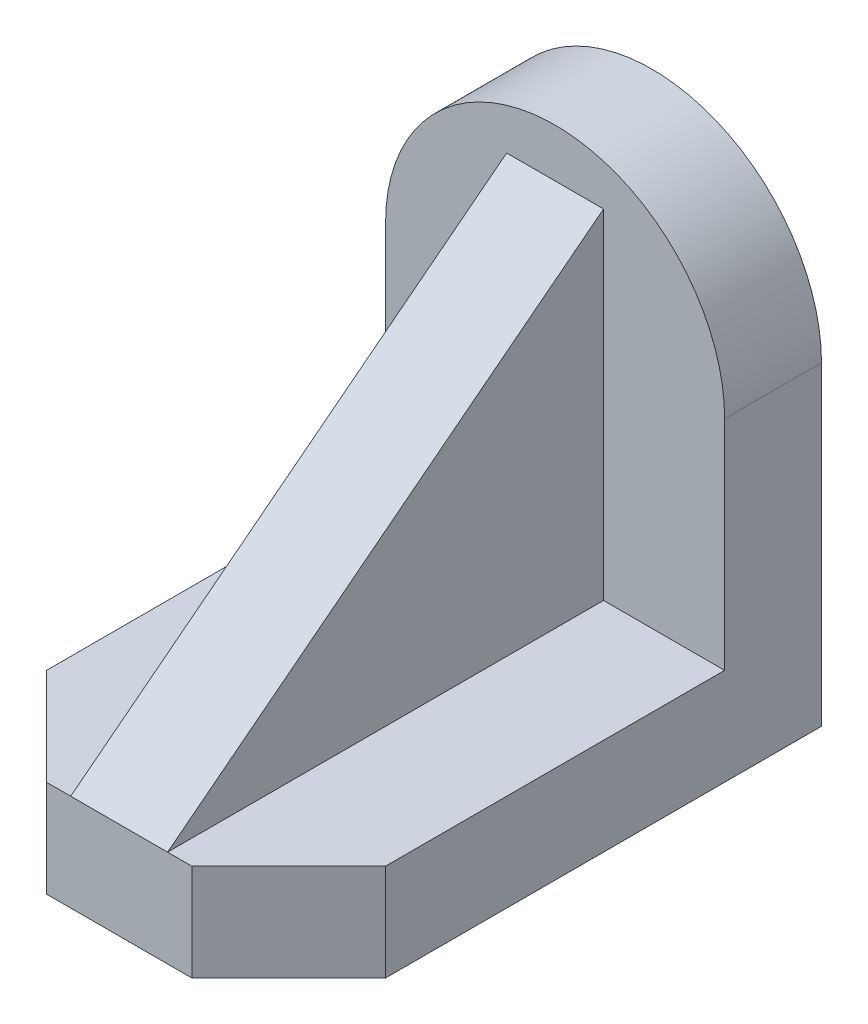
ISO-10303-21;
HEADER;
FILE_DESCRIPTION(('STEP AP214'),'2;1');
FILE_NAME('part.step','',(''),(''),'','','');
FILE_SCHEMA(('AUTOMOTIVE_DESIGN { 1 0 10303 214 1 1 1 1 }'));
ENDSEC;
DATA;
#1=APPLICATION_CONTEXT('core data for automotive mechanical design processes');
#2=APPLICATION_PROTOCOL_DEFINITION('international standard','automotive_design',2000,#1);
#3=PRODUCT_CONTEXT('',#1,'mechanical');
#4=PRODUCT('Part','Part','',(#3));
#5=PRODUCT_RELATED_PRODUCT_CATEGORY('part','',(#4));
#6=PRODUCT_DEFINITION_FORMATION('','',#4);
#7=PRODUCT_DEFINITION_CONTEXT('part definition',#1,'design');
#8=PRODUCT_DEFINITION('design','',#6,#7);
#9=PRODUCT_DEFINITION_SHAPE('','',#8);
#10=(LENGTH_UNIT() NAMED_UNIT(*) SI_UNIT(.MILLI.,.METRE.));
#11=(NAMED_UNIT(*) PLANE_ANGLE_UNIT() SI_UNIT($,.RADIAN.));
#12=(NAMED_UNIT(*) SI_UNIT($,.STERADIAN.) SOLID_ANGLE_UNIT());
#13=UNCERTAINTY_MEASURE_WITH_UNIT(LENGTH_MEASURE(1.E-05),#10,'distance_accuracy_value','');
#14=(GEOMETRIC_REPRESENTATION_CONTEXT(3) GLOBAL_UNCERTAINTY_ASSIGNED_CONTEXT((#13)) GLOBAL_UNIT_ASSIGNED_CONTEXT((#10,
#11,#12)) REPRESENTATION_CONTEXT('',''));
#15=CARTESIAN_POINT('',(0.,0.,0.));
#16=DIRECTION('',(0.,0.,1.));
#17=DIRECTION('',(1.,0.,0.));
#18=AXIS2_PLACEMENT_3D('',#15,#16,#17);
#19=CARTESIAN_POINT('',(0.,12.,0.));
#20=DIRECTION('',(0.,-1.,0.));
#21=DIRECTION('',(0.,0.,-1.));
#22=AXIS2_PLACEMENT_3D('',#19,#20,#21);
#23=PLANE('',#22);
#24=DIRECTION('',(0.,0.,-1.));
#25=VECTOR('',#24,1.);
#26=CARTESIAN_POINT('',(-6.,12.,33.));
#27=LINE('',#26,#25);
#28=CARTESIAN_POINT('',(-6.,12.,33.));
#29=VERTEX_POINT('',#28);
#30=CARTESIAN_POINT('',(-6.,12.,-21.));
#31=VERTEX_POINT('',#30);
#32=EDGE_CURVE('E142',#29,#31,#27,.T.);
#33=ORIENTED_EDGE('',*,*,#32,.T.);
#34=DIRECTION('',(1.,0.,0.));
#35=VECTOR('',#34,1.);
#36=CARTESIAN_POINT('',(21.,12.,-21.));
#37=LINE('',#36,#35);
#38=CARTESIAN_POINT('',(-21.,12.,-21.));
#39=VERTEX_POINT('',#38);
#40=EDGE_CURVE('E127',#39,#31,#37,.T.);
#41=ORIENTED_EDGE('',*,*,#40,.F.);
#42=DIRECTION('',(0.,0.,1.));
#43=VECTOR('',#42,1.);
#44=CARTESIAN_POINT('',(-21.,12.,33.));
#45=LINE('',#44,#43);
#46=CARTESIAN_POINT('',(-21.,12.,21.));
#47=VERTEX_POINT('',#46);
#48=EDGE_CURVE('E189',#39,#47,#45,.T.);
#49=ORIENTED_EDGE('',*,*,#48,.T.);
#50=DIRECTION('',(-0.707106781186546,0.,-0.707106781186549));
#51=VECTOR('',#50,1.);
#52=CARTESIAN_POINT('',(-9.00000000000002,12.,33.));
#53=LINE('',#52,#51);
#54=CARTESIAN_POINT('',(-9.00000000000002,12.,33.));
#55=VERTEX_POINT('',#54);
#56=EDGE_CURVE('E51',#47,#55,#53,.F.);
#57=ORIENTED_EDGE('',*,*,#56,.T.);
#58=DIRECTION('',(1.,0.,0.));
#59=VECTOR('',#58,1.);
#60=CARTESIAN_POINT('',(-21.,12.,33.));
#61=LINE('',#60,#59);
#62=EDGE_CURVE('E143',#55,#29,#61,.T.);
#63=ORIENTED_EDGE('',*,*,#62,.T.);
#64=EDGE_LOOP('',(#33,#41,#49,#57,#63));
#65=FACE_BOUND('',#64,.T.);
#66=ADVANCED_FACE('F41',(#65),#23,.F.);
#67=CARTESIAN_POINT('',(6.,12.,-21.));
#68=VERTEX_POINT('',#67);
#69=CARTESIAN_POINT('',(21.,12.,-21.));
#70=VERTEX_POINT('',#69);
#71=EDGE_CURVE('E139',#68,#70,#37,.T.);
#72=ORIENTED_EDGE('',*,*,#71,.F.);
#73=DIRECTION('',(0.,0.,-1.));
#74=VECTOR('',#73,1.);
#75=CARTESIAN_POINT('',(6.,12.,33.));
#76=LINE('',#75,#74);
#77=CARTESIAN_POINT('',(6.,12.,33.));
#78=VERTEX_POINT('',#77);
#79=EDGE_CURVE('E58',#78,#68,#76,.T.);
#80=ORIENTED_EDGE('',*,*,#79,.F.);
#81=CARTESIAN_POINT('',(8.99999999999993,12.,33.));
#82=VERTEX_POINT('',#81);
#83=EDGE_CURVE('E193',#78,#82,#61,.T.);
#84=ORIENTED_EDGE('',*,*,#83,.T.);
#85=DIRECTION('',(-0.707106781186549,0.,0.707106781186546));
#86=VECTOR('',#85,1.);
#87=CARTESIAN_POINT('',(21.,12.,21.));
#88=LINE('',#87,#86);
#89=CARTESIAN_POINT('',(21.,12.,21.));
#90=VERTEX_POINT('',#89);
#91=EDGE_CURVE('E234',#82,#90,#88,.F.);
#92=ORIENTED_EDGE('',*,*,#91,.T.);
#93=DIRECTION('',(0.,0.,-1.));
#94=VECTOR('',#93,1.);
#95=CARTESIAN_POINT('',(21.,12.,33.));
#96=LINE('',#95,#94);
#97=EDGE_CURVE('E185',#90,#70,#96,.T.);
#98=ORIENTED_EDGE('',*,*,#97,.T.);
#99=EDGE_LOOP('',(#72,#80,#84,#92,#98));
#100=FACE_BOUND('',#99,.T.);
#101=ADVANCED_FACE('F265',(#100),#23,.F.);
#102=CARTESIAN_POINT('',(21.,12.,33.));
#103=DIRECTION('',(-1.,0.,0.));
#104=DIRECTION('',(0.,0.,1.));
#105=AXIS2_PLACEMENT_3D('',#102,#103,#104);
#106=PLANE('',#105);
#107=ORIENTED_EDGE('',*,*,#97,.F.);
#108=DIRECTION('',(0.,-1.,0.));
#109=VECTOR('',#108,1.);
#110=CARTESIAN_POINT('',(21.,12.,21.));
#111=LINE('',#110,#109);
#112=CARTESIAN_POINT('',(21.,0.,21.));
#113=VERTEX_POINT('',#112);
#114=EDGE_CURVE('E11',#90,#113,#111,.T.);
#115=ORIENTED_EDGE('',*,*,#114,.T.);
#116=DIRECTION('',(0.,0.,-1.));
#117=VECTOR('',#116,1.);
#118=CARTESIAN_POINT('',(21.,0.,33.));
#119=LINE('',#118,#117);
#120=CARTESIAN_POINT('',(21.,0.,-33.));
#121=VERTEX_POINT('',#120);
#122=EDGE_CURVE('E184',#113,#121,#119,.T.);
#123=ORIENTED_EDGE('',*,*,#122,.T.);
#124=DIRECTION('',(0.,-1.,0.));
#125=VECTOR('',#124,1.);
#126=CARTESIAN_POINT('',(21.,12.,-33.));
#127=LINE('',#126,#125);
#128=CARTESIAN_POINT('',(21.,39.,-33.));
#129=VERTEX_POINT('',#128);
#130=EDGE_CURVE('E212',#129,#121,#127,.T.);
#131=ORIENTED_EDGE('',*,*,#130,.F.);
#132=DIRECTION('',(0.,0.,-1.));
#133=VECTOR('',#132,1.);
#134=CARTESIAN_POINT('',(21.,39.,-33.));
#135=LINE('',#134,#133);
#136=CARTESIAN_POINT('',(21.,39.,-21.));
#137=VERTEX_POINT('',#136);
#138=EDGE_CURVE('E138',#137,#129,#135,.T.);
#139=ORIENTED_EDGE('',*,*,#138,.F.);
#140=DIRECTION('',(0.,-1.,0.));
#141=VECTOR('',#140,1.);
#142=CARTESIAN_POINT('',(21.,39.,-21.));
#143=LINE('',#142,#141);
#144=EDGE_CURVE('E177',#137,#70,#143,.T.);
#145=ORIENTED_EDGE('',*,*,#144,.T.);
#146=EDGE_LOOP('',(#107,#115,#123,#131,#139,#145));
#147=FACE_BOUND('',#146,.T.);
#148=ADVANCED_FACE('F259',(#147),#106,.F.);
#149=CARTESIAN_POINT('',(-21.,12.,-33.));
#150=DIRECTION('',(0.,0.,1.));
#151=DIRECTION('',(1.,0.,0.));
#152=AXIS2_PLACEMENT_3D('',#149,#150,#151);
#153=PLANE('',#152);
#154=DIRECTION('',(-1.,0.,0.));
#155=VECTOR('',#154,1.);
#156=CARTESIAN_POINT('',(-21.,0.,-33.));
#157=LINE('',#156,#155);
#158=CARTESIAN_POINT('',(-21.,0.,-33.));
#159=VERTEX_POINT('',#158);
#160=EDGE_CURVE('E199',#121,#159,#157,.T.);
#161=ORIENTED_EDGE('',*,*,#160,.T.);
#162=DIRECTION('',(0.,-1.,0.));
#163=VECTOR('',#162,1.);
#164=CARTESIAN_POINT('',(-21.,12.,-33.));
#165=LINE('',#164,#163);
#166=CARTESIAN_POINT('',(-21.,38.9999999999999,-33.));
#167=VERTEX_POINT('',#166);
#168=EDGE_CURVE('E196',#167,#159,#165,.T.);
#169=ORIENTED_EDGE('',*,*,#168,.F.);
#170=CARTESIAN_POINT('',(0.,39.,-33.));
#171=DIRECTION('',(0.,0.,-1.));
#172=DIRECTION('',(-1.,0.,0.));
#173=AXIS2_PLACEMENT_3D('',#170,#171,#172);
#174=CIRCLE('',#173,21.);
#175=EDGE_CURVE('E163',#167,#129,#174,.T.);
#176=ORIENTED_EDGE('',*,*,#175,.T.);
#177=ORIENTED_EDGE('',*,*,#130,.T.);
#178=EDGE_LOOP('',(#161,#169,#176,#177));
#179=FACE_BOUND('',#178,.T.);
#180=ADVANCED_FACE('F253',(#179),#153,.F.);
#181=CARTESIAN_POINT('',(-21.,12.,33.));
#182=DIRECTION('',(1.,0.,0.));
#183=DIRECTION('',(0.,0.,-1.));
#184=AXIS2_PLACEMENT_3D('',#181,#182,#183);
#185=PLANE('',#184);
#186=DIRECTION('',(0.,0.,1.));
#187=VECTOR('',#186,1.);
#188=CARTESIAN_POINT('',(-21.,0.,33.));
#189=LINE('',#188,#187);
#190=CARTESIAN_POINT('',(-21.,0.,21.));
#191=VERTEX_POINT('',#190);
#192=EDGE_CURVE('E202',#159,#191,#189,.T.);
#193=ORIENTED_EDGE('',*,*,#192,.T.);
#194=DIRECTION('',(0.,1.,0.));
#195=VECTOR('',#194,1.);
#196=CARTESIAN_POINT('',(-21.,12.,21.));
#197=LINE('',#196,#195);
#198=EDGE_CURVE('E230',#191,#47,#197,.T.);
#199=ORIENTED_EDGE('',*,*,#198,.T.);
#200=ORIENTED_EDGE('',*,*,#48,.F.);
#201=DIRECTION('',(0.,-1.,0.));
#202=VECTOR('',#201,1.);
#203=CARTESIAN_POINT('',(-21.,39.,-21.));
#204=LINE('',#203,#202);
#205=CARTESIAN_POINT('',(-21.,39.,-21.));
#206=VERTEX_POINT('',#205);
#207=EDGE_CURVE('E134',#206,#39,#204,.T.);
#208=ORIENTED_EDGE('',*,*,#207,.F.);
#209=DIRECTION('',(0.,0.,1.));
#210=VECTOR('',#209,1.);
#211=CARTESIAN_POINT('',(-21.,39.,-33.));
#212=LINE('',#211,#210);
#213=EDGE_CURVE('E174',#167,#206,#212,.T.);
#214=ORIENTED_EDGE('',*,*,#213,.F.);
#215=ORIENTED_EDGE('',*,*,#168,.T.);
#216=EDGE_LOOP('',(#193,#199,#200,#208,#214,#215));
#217=FACE_BOUND('',#216,.T.);
#218=ADVANCED_FACE('F249',(#217),#185,.F.);
#219=CARTESIAN_POINT('',(-21.,12.,33.));
#220=DIRECTION('',(0.,0.,-1.));
#221=DIRECTION('',(-1.,0.,0.));
#222=AXIS2_PLACEMENT_3D('',#219,#220,#221);
#223=PLANE('',#222);
#224=ORIENTED_EDGE('',*,*,#62,.F.);
#225=DIRECTION('',(0.,-1.,0.));
#226=VECTOR('',#225,1.);
#227=CARTESIAN_POINT('',(-9.00000000000002,12.,33.));
#228=LINE('',#227,#226);
#229=CARTESIAN_POINT('',(-9.00000000000002,0.,33.));
#230=VERTEX_POINT('',#229);
#231=EDGE_CURVE('E220',#55,#230,#228,.T.);
#232=ORIENTED_EDGE('',*,*,#231,.T.);
#233=DIRECTION('',(1.,0.,0.));
#234=VECTOR('',#233,1.);
#235=CARTESIAN_POINT('',(-21.,0.,33.));
#236=LINE('',#235,#234);
#237=CARTESIAN_POINT('',(8.99999999999993,0.,33.));
#238=VERTEX_POINT('',#237);
#239=EDGE_CURVE('E190',#230,#238,#236,.T.);
#240=ORIENTED_EDGE('',*,*,#239,.T.);
#241=DIRECTION('',(0.,1.,0.));
#242=VECTOR('',#241,1.);
#243=CARTESIAN_POINT('',(8.99999999999993,12.,33.));
#244=LINE('',#243,#242);
#245=EDGE_CURVE('E216',#238,#82,#244,.T.);
#246=ORIENTED_EDGE('',*,*,#245,.T.);
#247=ORIENTED_EDGE('',*,*,#83,.F.);
#248=DIRECTION('',(-1.,0.,0.));
#249=VECTOR('',#248,1.);
#250=CARTESIAN_POINT('',(6.,12.,33.));
#251=LINE('',#250,#249);
#252=EDGE_CURVE('E65',#78,#29,#251,.T.);
#253=ORIENTED_EDGE('',*,*,#252,.T.);
#254=EDGE_LOOP('',(#224,#232,#240,#246,#247,#253));
#255=FACE_BOUND('',#254,.T.);
#256=ADVANCED_FACE('F241',(#255),#223,.F.);
#257=CARTESIAN_POINT('',(0.,0.,0.));
#258=DIRECTION('',(0.,-1.,0.));
#259=DIRECTION('',(0.,0.,-1.));
#260=AXIS2_PLACEMENT_3D('',#257,#258,#259);
#261=PLANE('',#260);
#262=ORIENTED_EDGE('',*,*,#239,.F.);
#263=DIRECTION('',(0.707106781186546,0.,0.707106781186549));
#264=VECTOR('',#263,1.);
#265=CARTESIAN_POINT('',(-21.,0.,21.));
#266=LINE('',#265,#264);
#267=EDGE_CURVE('E227',#230,#191,#266,.F.);
#268=ORIENTED_EDGE('',*,*,#267,.T.);
#269=ORIENTED_EDGE('',*,*,#192,.F.);
#270=ORIENTED_EDGE('',*,*,#160,.F.);
#271=ORIENTED_EDGE('',*,*,#122,.F.);
#272=DIRECTION('',(0.707106781186549,0.,-0.707106781186546));
#273=VECTOR('',#272,1.);
#274=CARTESIAN_POINT('',(21.,0.,21.));
#275=LINE('',#274,#273);
#276=EDGE_CURVE('E224',#113,#238,#275,.F.);
#277=ORIENTED_EDGE('',*,*,#276,.T.);
#278=EDGE_LOOP('',(#262,#268,#269,#270,#271,#277));
#279=FACE_BOUND('',#278,.T.);
#280=ADVANCED_FACE('F246',(#279),#261,.T.);
#281=CARTESIAN_POINT('',(-9.00000000000002,12.,33.));
#282=DIRECTION('',(0.707106781186549,0.,-0.707106781186546));
#283=DIRECTION('',(0.,-1.,0.));
#284=AXIS2_PLACEMENT_3D('',#281,#282,#283);
#285=PLANE('',#284);
#286=ORIENTED_EDGE('',*,*,#56,.F.);
#287=ORIENTED_EDGE('',*,*,#198,.F.);
#288=ORIENTED_EDGE('',*,*,#267,.F.);
#289=ORIENTED_EDGE('',*,*,#231,.F.);
#290=EDGE_LOOP('',(#286,#287,#288,#289));
#291=FACE_BOUND('',#290,.T.);
#292=ADVANCED_FACE('F243',(#291),#285,.F.);
#293=CARTESIAN_POINT('',(21.,12.,21.));
#294=DIRECTION('',(-0.707106781186546,0.,-0.707106781186549));
#295=DIRECTION('',(0.,-1.,0.));
#296=AXIS2_PLACEMENT_3D('',#293,#294,#295);
#297=PLANE('',#296);
#298=ORIENTED_EDGE('',*,*,#91,.F.);
#299=ORIENTED_EDGE('',*,*,#245,.F.);
#300=ORIENTED_EDGE('',*,*,#276,.F.);
#301=ORIENTED_EDGE('',*,*,#114,.F.);
#302=EDGE_LOOP('',(#298,#299,#300,#301));
#303=FACE_BOUND('',#302,.T.);
#304=ADVANCED_FACE('F44',(#303),#297,.F.);
#305=CARTESIAN_POINT('',(21.,39.,-21.));
#306=DIRECTION('',(0.,0.,-1.));
#307=DIRECTION('',(-1.,0.,0.));
#308=AXIS2_PLACEMENT_3D('',#305,#306,#307);
#309=PLANE('',#308);
#310=DIRECTION('',(-1.,0.,0.));
#311=VECTOR('',#310,1.);
#312=CARTESIAN_POINT('',(6.,54.,-21.));
#313=LINE('',#312,#311);
#314=CARTESIAN_POINT('',(6.,54.,-21.));
#315=VERTEX_POINT('',#314);
#316=CARTESIAN_POINT('',(-6.,54.,-21.));
#317=VERTEX_POINT('',#316);
#318=EDGE_CURVE('E159',#315,#317,#313,.T.);
#319=ORIENTED_EDGE('',*,*,#318,.F.);
#320=DIRECTION('',(0.,1.,0.));
#321=VECTOR('',#320,1.);
#322=CARTESIAN_POINT('',(6.,12.,-21.));
#323=LINE('',#322,#321);
#324=EDGE_CURVE('E271',#68,#315,#323,.T.);
#325=ORIENTED_EDGE('',*,*,#324,.F.);
#326=ORIENTED_EDGE('',*,*,#71,.T.);
#327=ORIENTED_EDGE('',*,*,#144,.F.);
#328=CARTESIAN_POINT('',(0.,39.,-21.));
#329=DIRECTION('',(0.,0.,-1.));
#330=DIRECTION('',(-1.,0.,0.));
#331=AXIS2_PLACEMENT_3D('',#328,#329,#330);
#332=CIRCLE('',#331,21.);
#333=EDGE_CURVE('E167',#206,#137,#332,.T.);
#334=ORIENTED_EDGE('',*,*,#333,.F.);
#335=ORIENTED_EDGE('',*,*,#207,.T.);
#336=ORIENTED_EDGE('',*,*,#40,.T.);
#337=DIRECTION('',(0.,1.,0.));
#338=VECTOR('',#337,1.);
#339=CARTESIAN_POINT('',(-6.,12.,-21.));
#340=LINE('',#339,#338);
#341=EDGE_CURVE('E131',#31,#317,#340,.T.);
#342=ORIENTED_EDGE('',*,*,#341,.T.);
#343=EDGE_LOOP('',(#319,#325,#326,#327,#334,#335,#336,#342));
#344=FACE_BOUND('',#343,.T.);
#345=ADVANCED_FACE('F129',(#344),#309,.F.);
#346=CARTESIAN_POINT('',(0.,39.,-33.));
#347=DIRECTION('',(0.,0.,-1.));
#348=DIRECTION('',(-1.,0.,0.));
#349=AXIS2_PLACEMENT_3D('',#346,#347,#348);
#350=CYLINDRICAL_SURFACE('',#349,21.);
#351=ORIENTED_EDGE('',*,*,#333,.T.);
#352=ORIENTED_EDGE('',*,*,#138,.T.);
#353=ORIENTED_EDGE('',*,*,#175,.F.);
#354=ORIENTED_EDGE('',*,*,#213,.T.);
#355=EDGE_LOOP('',(#351,#352,#353,#354));
#356=FACE_BOUND('',#355,.T.);
#357=ADVANCED_FACE('F255',(#356),#350,.T.);
#358=CARTESIAN_POINT('',(6.,54.,-21.));
#359=DIRECTION('',(0.,-0.789352217376326,-0.613940613514921));
#360=DIRECTION('',(0.,0.613940613514921,-0.789352217376326));
#361=AXIS2_PLACEMENT_3D('',#358,#359,#360);
#362=PLANE('',#361);
#363=DIRECTION('',(0.,-0.613940613514921,0.789352217376326));
#364=VECTOR('',#363,1.);
#365=CARTESIAN_POINT('',(-6.,54.,-21.));
#366=LINE('',#365,#364);
#367=EDGE_CURVE('E150',#317,#29,#366,.T.);
#368=ORIENTED_EDGE('',*,*,#367,.T.);
#369=ORIENTED_EDGE('',*,*,#252,.F.);
#370=DIRECTION('',(0.,-0.613940613514921,0.789352217376326));
#371=VECTOR('',#370,1.);
#372=CARTESIAN_POINT('',(6.,54.,-21.));
#373=LINE('',#372,#371);
#374=EDGE_CURVE('E160',#315,#78,#373,.T.);
#375=ORIENTED_EDGE('',*,*,#374,.F.);
#376=ORIENTED_EDGE('',*,*,#318,.T.);
#377=EDGE_LOOP('',(#368,#369,#375,#376));
#378=FACE_BOUND('',#377,.T.);
#379=ADVANCED_FACE('F280',(#378),#362,.F.);
#380=CARTESIAN_POINT('',(6.,0.,0.));
#381=DIRECTION('',(1.,0.,0.));
#382=DIRECTION('',(0.,0.,-1.));
#383=AXIS2_PLACEMENT_3D('',#380,#381,#382);
#384=PLANE('',#383);
#385=ORIENTED_EDGE('',*,*,#79,.T.);
#386=ORIENTED_EDGE('',*,*,#324,.T.);
#387=ORIENTED_EDGE('',*,*,#374,.T.);
#388=EDGE_LOOP('',(#385,#386,#387));
#389=FACE_BOUND('',#388,.T.);
#390=ADVANCED_FACE('F277',(#389),#384,.T.);
#391=CARTESIAN_POINT('',(-6.,0.,0.));
#392=DIRECTION('',(1.,0.,0.));
#393=DIRECTION('',(0.,0.,-1.));
#394=AXIS2_PLACEMENT_3D('',#391,#392,#393);
#395=PLANE('',#394);
#396=ORIENTED_EDGE('',*,*,#32,.F.);
#397=ORIENTED_EDGE('',*,*,#367,.F.);
#398=ORIENTED_EDGE('',*,*,#341,.F.);
#399=EDGE_LOOP('',(#396,#397,#398));
#400=FACE_BOUND('',#399,.T.);
#401=ADVANCED_FACE('F149',(#400),#395,.F.);
#402=CLOSED_SHELL('',(#66,#101,#148,#180,#218,#256,#280,#292,#304,#345,#357,#379,#390,#401));
#403=MANIFOLD_SOLID_BREP('B2',#402);
#404=ADVANCED_BREP_SHAPE_REPRESENTATION('',(#18,#403),#14);
#405=SHAPE_DEFINITION_REPRESENTATION(#9,#404);
ENDSEC;
END-ISO-10303-21;
